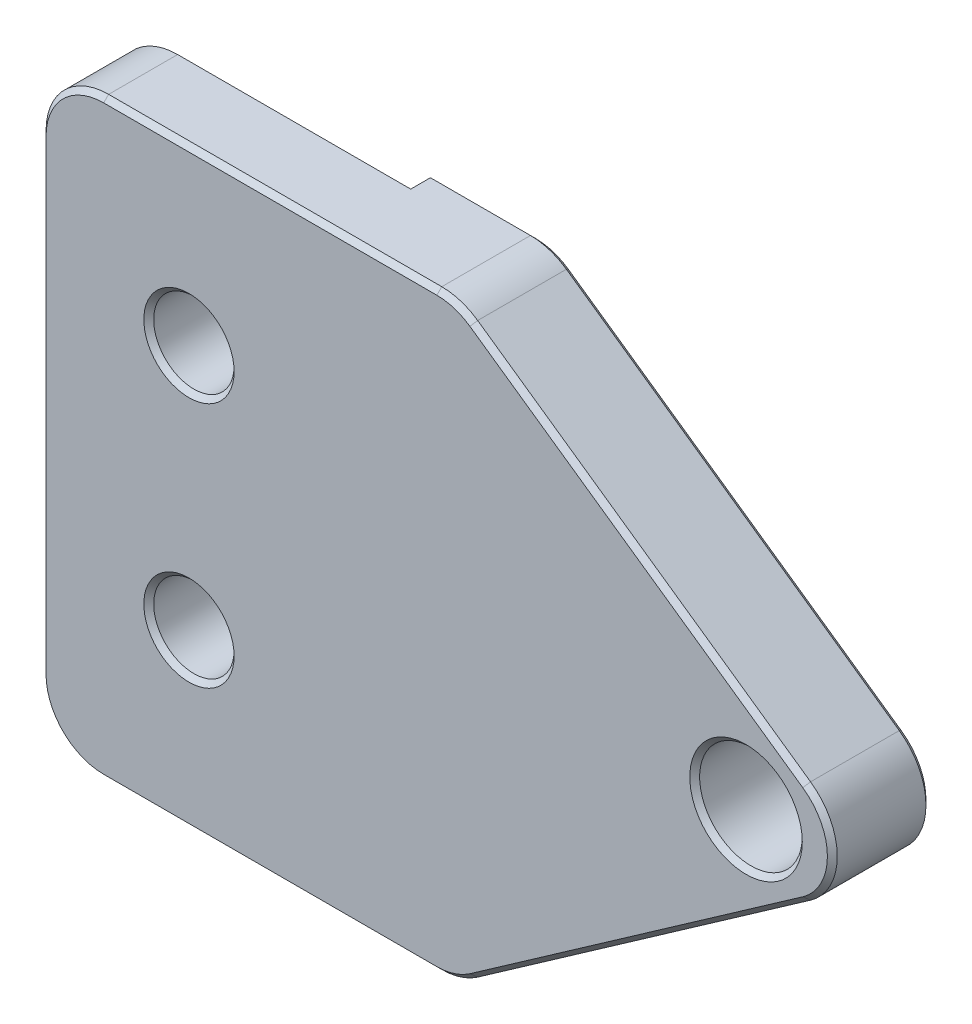
ISO-10303-21;
HEADER;
FILE_DESCRIPTION(('STEP AP214'),'2;1');
FILE_NAME('part.step','',(''),(''),'','','');
FILE_SCHEMA(('AUTOMOTIVE_DESIGN { 1 0 10303 214 1 1 1 1 }'));
ENDSEC;
DATA;
#1=APPLICATION_CONTEXT('core data for automotive mechanical design processes');
#2=APPLICATION_PROTOCOL_DEFINITION('international standard','automotive_design',2000,#1);
#3=PRODUCT_CONTEXT('',#1,'mechanical');
#4=PRODUCT('Part','Part','',(#3));
#5=PRODUCT_RELATED_PRODUCT_CATEGORY('part','',(#4));
#6=PRODUCT_DEFINITION_FORMATION('','',#4);
#7=PRODUCT_DEFINITION_CONTEXT('part definition',#1,'design');
#8=PRODUCT_DEFINITION('design','',#6,#7);
#9=PRODUCT_DEFINITION_SHAPE('','',#8);
#10=(LENGTH_UNIT() NAMED_UNIT(*) SI_UNIT(.MILLI.,.METRE.));
#11=(NAMED_UNIT(*) PLANE_ANGLE_UNIT() SI_UNIT($,.RADIAN.));
#12=(NAMED_UNIT(*) SI_UNIT($,.STERADIAN.) SOLID_ANGLE_UNIT());
#13=UNCERTAINTY_MEASURE_WITH_UNIT(LENGTH_MEASURE(1.E-05),#10,'distance_accuracy_value','');
#14=(GEOMETRIC_REPRESENTATION_CONTEXT(3) GLOBAL_UNCERTAINTY_ASSIGNED_CONTEXT((#13)) GLOBAL_UNIT_ASSIGNED_CONTEXT((#10,
#11,#12)) REPRESENTATION_CONTEXT('',''));
#15=CARTESIAN_POINT('',(0.,0.,0.));
#16=DIRECTION('',(0.,0.,1.));
#17=DIRECTION('',(1.,0.,0.));
#18=AXIS2_PLACEMENT_3D('',#15,#16,#17);
#19=CARTESIAN_POINT('',(-17.1377760809055,-12.,4.));
#20=DIRECTION('',(-0.573576436351044,0.819152044288993,0.));
#21=DIRECTION('',(-0.819152044288993,-0.573576436351044,0.));
#22=AXIS2_PLACEMENT_3D('',#19,#20,#21);
#23=PLANE('',#22);
#24=DIRECTION('',(0.,0.,-1.));
#25=VECTOR('',#24,1.);
#26=CARTESIAN_POINT('',(-2.97147071254595,-2.08064619249404,4.));
#27=LINE('',#26,#25);
#28=CARTESIAN_POINT('',(-2.97147071254595,-2.08064619249404,0.199999999999995));
#29=VERTEX_POINT('',#28);
#30=CARTESIAN_POINT('',(-2.97147071254595,-2.08064619249404,3.8));
#31=VERTEX_POINT('',#30);
#32=EDGE_CURVE('E230',#29,#31,#27,.F.);
#33=ORIENTED_EDGE('',*,*,#32,.T.);
#34=DIRECTION('',(-0.819152044288993,-0.573576436351044,0.));
#35=VECTOR('',#34,1.);
#36=CARTESIAN_POINT('',(-16.4817508563264,-11.540646192494,3.8));
#37=LINE('',#36,#35);
#38=CARTESIAN_POINT('',(-16.4817508563264,-11.540646192494,3.8));
#39=VERTEX_POINT('',#38);
#40=EDGE_CURVE('E299',#31,#39,#37,.T.);
#41=ORIENTED_EDGE('',*,*,#40,.T.);
#42=DIRECTION('',(0.,0.,-1.));
#43=VECTOR('',#42,1.);
#44=CARTESIAN_POINT('',(-16.4817508563264,-11.540646192494,4.));
#45=LINE('',#44,#43);
#46=CARTESIAN_POINT('',(-16.4817508563264,-11.540646192494,0.199999999999994));
#47=VERTEX_POINT('',#46);
#48=EDGE_CURVE('E233',#39,#47,#45,.T.);
#49=ORIENTED_EDGE('',*,*,#48,.T.);
#50=DIRECTION('',(0.819152044288993,0.573576436351044,0.));
#51=VECTOR('',#50,1.);
#52=CARTESIAN_POINT('',(-17.1377760809055,-12.,0.199999999999994));
#53=LINE('',#52,#51);
#54=EDGE_CURVE('E297',#47,#29,#53,.T.);
#55=ORIENTED_EDGE('',*,*,#54,.T.);
#56=EDGE_LOOP('',(#33,#41,#49,#55));
#57=FACE_BOUND('',#56,.T.);
#58=ADVANCED_FACE('F32',(#57),#23,.F.);
#59=CARTESIAN_POINT('',(0.,0.,4.));
#60=DIRECTION('',(-0.573576436351044,-0.819152044288993,0.));
#61=DIRECTION('',(0.819152044288993,-0.573576436351044,0.));
#62=AXIS2_PLACEMENT_3D('',#59,#60,#61);
#63=PLANE('',#62);
#64=DIRECTION('',(0.,0.,-1.));
#65=VECTOR('',#64,1.);
#66=CARTESIAN_POINT('',(-16.4817508563264,11.540646192494,4.));
#67=LINE('',#66,#65);
#68=CARTESIAN_POINT('',(-16.4817508563264,11.540646192494,0.199999999999995));
#69=VERTEX_POINT('',#68);
#70=CARTESIAN_POINT('',(-16.4817508563264,11.540646192494,3.8));
#71=VERTEX_POINT('',#70);
#72=EDGE_CURVE('E236',#69,#71,#67,.F.);
#73=ORIENTED_EDGE('',*,*,#72,.T.);
#74=DIRECTION('',(0.819152044288993,-0.573576436351044,0.));
#75=VECTOR('',#74,1.);
#76=CARTESIAN_POINT('',(-2.97147071254595,2.08064619249404,3.8));
#77=LINE('',#76,#75);
#78=CARTESIAN_POINT('',(-2.97147071254595,2.08064619249404,3.8));
#79=VERTEX_POINT('',#78);
#80=EDGE_CURVE('E291',#71,#79,#77,.T.);
#81=ORIENTED_EDGE('',*,*,#80,.T.);
#82=DIRECTION('',(0.,0.,-1.));
#83=VECTOR('',#82,1.);
#84=CARTESIAN_POINT('',(-2.97147071254595,2.08064619249404,4.));
#85=LINE('',#84,#83);
#86=CARTESIAN_POINT('',(-2.97147071254595,2.08064619249404,0.199999999999994));
#87=VERTEX_POINT('',#86);
#88=EDGE_CURVE('E239',#79,#87,#85,.T.);
#89=ORIENTED_EDGE('',*,*,#88,.T.);
#90=DIRECTION('',(-0.819152044288993,0.573576436351044,0.));
#91=VECTOR('',#90,1.);
#92=CARTESIAN_POINT('',(0.,0.,0.199999999999994));
#93=LINE('',#92,#91);
#94=EDGE_CURVE('E289',#87,#69,#93,.T.);
#95=ORIENTED_EDGE('',*,*,#94,.T.);
#96=EDGE_LOOP('',(#73,#81,#89,#95));
#97=FACE_BOUND('',#96,.T.);
#98=ADVANCED_FACE('F454',(#97),#63,.F.);
#99=CARTESIAN_POINT('',(-17.1377760809055,12.,4.));
#100=DIRECTION('',(0.,-1.,0.));
#101=DIRECTION('',(0.,0.,-1.));
#102=AXIS2_PLACEMENT_3D('',#99,#100,#101);
#103=PLANE('',#102);
#104=DIRECTION('',(0.,0.,-1.));
#105=VECTOR('',#104,1.);
#106=CARTESIAN_POINT('',(-31.46,12.,4.));
#107=LINE('',#106,#105);
#108=CARTESIAN_POINT('',(-31.46,12.,1.));
#109=VERTEX_POINT('',#108);
#110=CARTESIAN_POINT('',(-31.46,12.,3.8));
#111=VERTEX_POINT('',#110);
#112=EDGE_CURVE('E242',#109,#111,#107,.F.);
#113=ORIENTED_EDGE('',*,*,#112,.T.);
#114=DIRECTION('',(1.,0.,0.));
#115=VECTOR('',#114,1.);
#116=CARTESIAN_POINT('',(-17.9386350046581,12.,3.8));
#117=LINE('',#116,#115);
#118=CARTESIAN_POINT('',(-17.9386350046581,12.,3.8));
#119=VERTEX_POINT('',#118);
#120=EDGE_CURVE('E283',#111,#119,#117,.T.);
#121=ORIENTED_EDGE('',*,*,#120,.T.);
#122=DIRECTION('',(0.,0.,-1.));
#123=VECTOR('',#122,1.);
#124=CARTESIAN_POINT('',(-17.9386350046581,12.,4.));
#125=LINE('',#124,#123);
#126=CARTESIAN_POINT('',(-17.9386350046581,12.,0.199999999999995));
#127=VERTEX_POINT('',#126);
#128=EDGE_CURVE('E245',#119,#127,#125,.T.);
#129=ORIENTED_EDGE('',*,*,#128,.T.);
#130=DIRECTION('',(-1.,0.,0.));
#131=VECTOR('',#130,1.);
#132=CARTESIAN_POINT('',(-17.1377760809055,12.,0.199999999999995));
#133=LINE('',#132,#131);
#134=CARTESIAN_POINT('',(-22.,12.,0.199999999999995));
#135=VERTEX_POINT('',#134);
#136=EDGE_CURVE('E281',#127,#135,#133,.T.);
#137=ORIENTED_EDGE('',*,*,#136,.T.);
#138=DIRECTION('',(0.,0.,-1.));
#139=VECTOR('',#138,1.);
#140=CARTESIAN_POINT('',(-22.,12.,0.));
#141=LINE('',#140,#139);
#142=CARTESIAN_POINT('',(-22.,12.,1.));
#143=VERTEX_POINT('',#142);
#144=EDGE_CURVE('E187',#143,#135,#141,.T.);
#145=ORIENTED_EDGE('',*,*,#144,.F.);
#146=DIRECTION('',(1.,0.,0.));
#147=VECTOR('',#146,1.);
#148=CARTESIAN_POINT('',(-34.,12.,1.));
#149=LINE('',#148,#147);
#150=EDGE_CURVE('E193',#109,#143,#149,.T.);
#151=ORIENTED_EDGE('',*,*,#150,.F.);
#152=EDGE_LOOP('',(#113,#121,#129,#137,#145,#151));
#153=FACE_BOUND('',#152,.T.);
#154=ADVANCED_FACE('F389',(#153),#103,.F.);
#155=CARTESIAN_POINT('',(-34.,0.,4.));
#156=DIRECTION('',(1.,0.,0.));
#157=DIRECTION('',(0.,0.,-1.));
#158=AXIS2_PLACEMENT_3D('',#155,#156,#157);
#159=PLANE('',#158);
#160=DIRECTION('',(0.,0.,-1.));
#161=VECTOR('',#160,1.);
#162=CARTESIAN_POINT('',(-34.,-9.46,4.));
#163=LINE('',#162,#161);
#164=CARTESIAN_POINT('',(-34.,-9.46,1.));
#165=VERTEX_POINT('',#164);
#166=CARTESIAN_POINT('',(-34.,-9.46,3.8));
#167=VERTEX_POINT('',#166);
#168=EDGE_CURVE('E227',#165,#167,#163,.F.);
#169=ORIENTED_EDGE('',*,*,#168,.T.);
#170=DIRECTION('',(0.,1.,0.));
#171=VECTOR('',#170,1.);
#172=CARTESIAN_POINT('',(-34.,9.46,3.8));
#173=LINE('',#172,#171);
#174=CARTESIAN_POINT('',(-34.,9.46,3.8));
#175=VERTEX_POINT('',#174);
#176=EDGE_CURVE('E311',#167,#175,#173,.T.);
#177=ORIENTED_EDGE('',*,*,#176,.T.);
#178=DIRECTION('',(0.,0.,-1.));
#179=VECTOR('',#178,1.);
#180=CARTESIAN_POINT('',(-34.,9.46,4.));
#181=LINE('',#180,#179);
#182=CARTESIAN_POINT('',(-34.,9.46,1.));
#183=VERTEX_POINT('',#182);
#184=EDGE_CURVE('E225',#175,#183,#181,.T.);
#185=ORIENTED_EDGE('',*,*,#184,.T.);
#186=DIRECTION('',(0.,1.,0.));
#187=VECTOR('',#186,1.);
#188=CARTESIAN_POINT('',(-34.,-12.,1.));
#189=LINE('',#188,#187);
#190=EDGE_CURVE('E198',#165,#183,#189,.T.);
#191=ORIENTED_EDGE('',*,*,#190,.F.);
#192=EDGE_LOOP('',(#169,#177,#185,#191));
#193=FACE_BOUND('',#192,.T.);
#194=ADVANCED_FACE('F419',(#193),#159,.F.);
#195=CARTESIAN_POINT('',(-34.,-12.,4.));
#196=DIRECTION('',(0.,1.,0.));
#197=DIRECTION('',(0.,0.,1.));
#198=AXIS2_PLACEMENT_3D('',#195,#196,#197);
#199=PLANE('',#198);
#200=DIRECTION('',(0.,0.,-1.));
#201=VECTOR('',#200,1.);
#202=CARTESIAN_POINT('',(-17.9386350046581,-12.,4.));
#203=LINE('',#202,#201);
#204=CARTESIAN_POINT('',(-17.9386350046581,-12.,0.199999999999995));
#205=VERTEX_POINT('',#204);
#206=CARTESIAN_POINT('',(-17.9386350046581,-12.,3.8));
#207=VERTEX_POINT('',#206);
#208=EDGE_CURVE('E212',#205,#207,#203,.F.);
#209=ORIENTED_EDGE('',*,*,#208,.T.);
#210=DIRECTION('',(-1.,0.,0.));
#211=VECTOR('',#210,1.);
#212=CARTESIAN_POINT('',(-31.46,-12.,3.8));
#213=LINE('',#212,#211);
#214=CARTESIAN_POINT('',(-31.46,-12.,3.8));
#215=VERTEX_POINT('',#214);
#216=EDGE_CURVE('E307',#207,#215,#213,.T.);
#217=ORIENTED_EDGE('',*,*,#216,.T.);
#218=DIRECTION('',(0.,0.,-1.));
#219=VECTOR('',#218,1.);
#220=CARTESIAN_POINT('',(-31.46,-12.,4.));
#221=LINE('',#220,#219);
#222=CARTESIAN_POINT('',(-31.46,-12.,1.));
#223=VERTEX_POINT('',#222);
#224=EDGE_CURVE('E184',#215,#223,#221,.T.);
#225=ORIENTED_EDGE('',*,*,#224,.T.);
#226=DIRECTION('',(1.,0.,0.));
#227=VECTOR('',#226,1.);
#228=CARTESIAN_POINT('',(-34.,-12.,1.));
#229=LINE('',#228,#227);
#230=CARTESIAN_POINT('',(-22.,-12.,1.));
#231=VERTEX_POINT('',#230);
#232=EDGE_CURVE('E175',#223,#231,#229,.T.);
#233=ORIENTED_EDGE('',*,*,#232,.T.);
#234=DIRECTION('',(0.,0.,-1.));
#235=VECTOR('',#234,1.);
#236=CARTESIAN_POINT('',(-22.,-12.,0.));
#237=LINE('',#236,#235);
#238=CARTESIAN_POINT('',(-22.,-12.,0.199999999999995));
#239=VERTEX_POINT('',#238);
#240=EDGE_CURVE('E181',#231,#239,#237,.T.);
#241=ORIENTED_EDGE('',*,*,#240,.T.);
#242=DIRECTION('',(1.,0.,0.));
#243=VECTOR('',#242,1.);
#244=CARTESIAN_POINT('',(-34.,-12.,0.199999999999995));
#245=LINE('',#244,#243);
#246=EDGE_CURVE('E305',#239,#205,#245,.T.);
#247=ORIENTED_EDGE('',*,*,#246,.T.);
#248=EDGE_LOOP('',(#209,#217,#225,#233,#241,#247));
#249=FACE_BOUND('',#248,.T.);
#250=ADVANCED_FACE('F178',(#249),#199,.F.);
#251=CARTESIAN_POINT('',(0.,0.,4.));
#252=DIRECTION('',(0.,0.,1.));
#253=DIRECTION('',(1.,0.,0.));
#254=AXIS2_PLACEMENT_3D('',#251,#252,#253);
#255=PLANE('',#254);
#256=DIRECTION('',(-1.,0.,0.));
#257=VECTOR('',#256,1.);
#258=CARTESIAN_POINT('',(-31.46,11.8,4.));
#259=LINE('',#258,#257);
#260=CARTESIAN_POINT('',(-17.9386350046581,11.8,4.));
#261=VERTEX_POINT('',#260);
#262=CARTESIAN_POINT('',(-31.46,11.8,4.));
#263=VERTEX_POINT('',#262);
#264=EDGE_CURVE('E273',#261,#263,#259,.T.);
#265=ORIENTED_EDGE('',*,*,#264,.T.);
#266=CARTESIAN_POINT('',(-31.46,9.46,4.));
#267=DIRECTION('',(0.,0.,1.));
#268=DIRECTION('',(1.,0.,0.));
#269=AXIS2_PLACEMENT_3D('',#266,#267,#268);
#270=CIRCLE('',#269,2.33999999999999);
#271=CARTESIAN_POINT('',(-33.8,9.46,4.));
#272=VERTEX_POINT('',#271);
#273=EDGE_CURVE('E275',#263,#272,#270,.T.);
#274=ORIENTED_EDGE('',*,*,#273,.T.);
#275=DIRECTION('',(0.,-1.,0.));
#276=VECTOR('',#275,1.);
#277=CARTESIAN_POINT('',(-33.8,-9.46,4.));
#278=LINE('',#277,#276);
#279=CARTESIAN_POINT('',(-33.8,-9.46,4.));
#280=VERTEX_POINT('',#279);
#281=EDGE_CURVE('E257',#272,#280,#278,.T.);
#282=ORIENTED_EDGE('',*,*,#281,.T.);
#283=CARTESIAN_POINT('',(-31.46,-9.46,4.));
#284=DIRECTION('',(0.,0.,1.));
#285=DIRECTION('',(1.,0.,0.));
#286=AXIS2_PLACEMENT_3D('',#283,#284,#285);
#287=CIRCLE('',#286,2.33999999999999);
#288=CARTESIAN_POINT('',(-31.46,-11.8,4.));
#289=VERTEX_POINT('',#288);
#290=EDGE_CURVE('E259',#280,#289,#287,.T.);
#291=ORIENTED_EDGE('',*,*,#290,.T.);
#292=DIRECTION('',(1.,0.,0.));
#293=VECTOR('',#292,1.);
#294=CARTESIAN_POINT('',(-17.9386350046581,-11.8,4.));
#295=LINE('',#294,#293);
#296=CARTESIAN_POINT('',(-17.9386350046581,-11.8,4.));
#297=VERTEX_POINT('',#296);
#298=EDGE_CURVE('E261',#289,#297,#295,.T.);
#299=ORIENTED_EDGE('',*,*,#298,.T.);
#300=CARTESIAN_POINT('',(-17.9386350046581,-9.46,4.));
#301=DIRECTION('',(0.,0.,1.));
#302=DIRECTION('',(1.,0.,0.));
#303=AXIS2_PLACEMENT_3D('',#300,#301,#302);
#304=CIRCLE('',#303,2.34);
#305=CARTESIAN_POINT('',(-16.5964661435966,-11.3768157836362,4.));
#306=VERTEX_POINT('',#305);
#307=EDGE_CURVE('E263',#297,#306,#304,.T.);
#308=ORIENTED_EDGE('',*,*,#307,.T.);
#309=DIRECTION('',(0.819152044288993,0.573576436351044,0.));
#310=VECTOR('',#309,1.);
#311=CARTESIAN_POINT('',(-3.08618599981616,-1.91681578363624,4.));
#312=LINE('',#311,#310);
#313=CARTESIAN_POINT('',(-3.08618599981616,-1.91681578363624,4.));
#314=VERTEX_POINT('',#313);
#315=EDGE_CURVE('E265',#306,#314,#312,.T.);
#316=ORIENTED_EDGE('',*,*,#315,.T.);
#317=CARTESIAN_POINT('',(-4.4283548608776,0.,4.));
#318=DIRECTION('',(0.,0.,1.));
#319=DIRECTION('',(1.,0.,0.));
#320=AXIS2_PLACEMENT_3D('',#317,#318,#319);
#321=CIRCLE('',#320,2.33999999999999);
#322=CARTESIAN_POINT('',(-3.08618599981616,1.91681578363624,4.));
#323=VERTEX_POINT('',#322);
#324=EDGE_CURVE('E267',#314,#323,#321,.T.);
#325=ORIENTED_EDGE('',*,*,#324,.T.);
#326=DIRECTION('',(-0.819152044288993,0.573576436351044,0.));
#327=VECTOR('',#326,1.);
#328=CARTESIAN_POINT('',(-16.5964661435966,11.3768157836362,4.));
#329=LINE('',#328,#327);
#330=CARTESIAN_POINT('',(-16.5964661435966,11.3768157836362,4.));
#331=VERTEX_POINT('',#330);
#332=EDGE_CURVE('E269',#323,#331,#329,.T.);
#333=ORIENTED_EDGE('',*,*,#332,.T.);
#334=CARTESIAN_POINT('',(-17.9386350046581,9.46,4.));
#335=DIRECTION('',(0.,0.,1.));
#336=DIRECTION('',(1.,0.,0.));
#337=AXIS2_PLACEMENT_3D('',#334,#335,#336);
#338=CIRCLE('',#337,2.33999999999999);
#339=EDGE_CURVE('E271',#331,#261,#338,.T.);
#340=ORIENTED_EDGE('',*,*,#339,.T.);
#341=EDGE_LOOP('',(#265,#274,#282,#291,#299,#308,#316,#325,#333,#340));
#342=FACE_BOUND('',#341,.T.);
#343=CARTESIAN_POINT('',(-28.,-5.,4.));
#344=DIRECTION('',(0.,0.,1.));
#345=DIRECTION('',(1.,0.,0.));
#346=AXIS2_PLACEMENT_3D('',#343,#344,#345);
#347=CIRCLE('',#346,1.83194999999999);
#348=CARTESIAN_POINT('',(-26.16805,-5.,4.));
#349=VERTEX_POINT('',#348);
#350=EDGE_CURVE('E254',#349,#349,#347,.F.);
#351=ORIENTED_EDGE('',*,*,#350,.T.);
#352=EDGE_LOOP('',(#351));
#353=FACE_BOUND('',#352,.T.);
#354=CARTESIAN_POINT('',(-28.,5.,4.));
#355=DIRECTION('',(0.,0.,1.));
#356=DIRECTION('',(1.,0.,0.));
#357=AXIS2_PLACEMENT_3D('',#354,#355,#356);
#358=CIRCLE('',#357,1.83194999999999);
#359=CARTESIAN_POINT('',(-26.16805,5.,4.));
#360=VERTEX_POINT('',#359);
#361=EDGE_CURVE('E251',#360,#360,#358,.F.);
#362=ORIENTED_EDGE('',*,*,#361,.T.);
#363=EDGE_LOOP('',(#362));
#364=FACE_BOUND('',#363,.T.);
#365=CARTESIAN_POINT('',(-5.39,0.,4.));
#366=DIRECTION('',(0.,0.,1.));
#367=DIRECTION('',(1.,0.,0.));
#368=AXIS2_PLACEMENT_3D('',#365,#366,#367);
#369=CIRCLE('',#368,2.28279999999999);
#370=CARTESIAN_POINT('',(-3.10720000000001,0.,4.));
#371=VERTEX_POINT('',#370);
#372=EDGE_CURVE('E248',#371,#371,#369,.F.);
#373=ORIENTED_EDGE('',*,*,#372,.T.);
#374=EDGE_LOOP('',(#373));
#375=FACE_BOUND('',#374,.T.);
#376=ADVANCED_FACE('F444',(#342,#353,#364,#375),#255,.T.);
#377=CARTESIAN_POINT('',(0.,0.,0.));
#378=DIRECTION('',(0.,0.,1.));
#379=DIRECTION('',(1.,0.,0.));
#380=AXIS2_PLACEMENT_3D('',#377,#378,#379);
#381=PLANE('',#380);
#382=CARTESIAN_POINT('',(-5.39,0.,0.));
#383=DIRECTION('',(0.,0.,1.));
#384=DIRECTION('',(1.,0.,0.));
#385=AXIS2_PLACEMENT_3D('',#382,#383,#384);
#386=CIRCLE('',#385,2.0828);
#387=CARTESIAN_POINT('',(-3.3072,0.,0.));
#388=VERTEX_POINT('',#387);
#389=EDGE_CURVE('E214',#388,#388,#386,.T.);
#390=ORIENTED_EDGE('',*,*,#389,.T.);
#391=EDGE_LOOP('',(#390));
#392=FACE_BOUND('',#391,.T.);
#393=CARTESIAN_POINT('',(-17.9386350046581,-9.46,0.));
#394=DIRECTION('',(0.,0.,1.));
#395=DIRECTION('',(1.,0.,0.));
#396=AXIS2_PLACEMENT_3D('',#393,#394,#395);
#397=CIRCLE('',#396,2.34000000000001);
#398=CARTESIAN_POINT('',(-16.5964661435966,-11.3768157836362,0.));
#399=VERTEX_POINT('',#398);
#400=CARTESIAN_POINT('',(-17.9386350046581,-11.8,0.));
#401=VERTEX_POINT('',#400);
#402=EDGE_CURVE('E49',#399,#401,#397,.F.);
#403=ORIENTED_EDGE('',*,*,#402,.T.);
#404=DIRECTION('',(-1.,0.,0.));
#405=VECTOR('',#404,1.);
#406=CARTESIAN_POINT('',(0.,-11.8,0.));
#407=LINE('',#406,#405);
#408=CARTESIAN_POINT('',(-22.,-11.8,0.));
#409=VERTEX_POINT('',#408);
#410=EDGE_CURVE('E332',#401,#409,#407,.T.);
#411=ORIENTED_EDGE('',*,*,#410,.T.);
#412=DIRECTION('',(0.,1.,0.));
#413=VECTOR('',#412,1.);
#414=CARTESIAN_POINT('',(-22.,-12.,0.));
#415=LINE('',#414,#413);
#416=CARTESIAN_POINT('',(-22.,11.8,0.));
#417=VERTEX_POINT('',#416);
#418=EDGE_CURVE('E197',#409,#417,#415,.T.);
#419=ORIENTED_EDGE('',*,*,#418,.T.);
#420=DIRECTION('',(1.,0.,0.));
#421=VECTOR('',#420,1.);
#422=CARTESIAN_POINT('',(0.,11.8,0.));
#423=LINE('',#422,#421);
#424=CARTESIAN_POINT('',(-17.9386350046581,11.8,0.));
#425=VERTEX_POINT('',#424);
#426=EDGE_CURVE('E322',#417,#425,#423,.T.);
#427=ORIENTED_EDGE('',*,*,#426,.T.);
#428=CARTESIAN_POINT('',(-17.9386350046581,9.46,0.));
#429=DIRECTION('',(0.,0.,1.));
#430=DIRECTION('',(1.,0.,0.));
#431=AXIS2_PLACEMENT_3D('',#428,#429,#430);
#432=CIRCLE('',#431,2.34);
#433=CARTESIAN_POINT('',(-16.5964661435966,11.3768157836362,0.));
#434=VERTEX_POINT('',#433);
#435=EDGE_CURVE('E324',#425,#434,#432,.F.);
#436=ORIENTED_EDGE('',*,*,#435,.T.);
#437=DIRECTION('',(0.819152044288993,-0.573576436351044,0.));
#438=VECTOR('',#437,1.);
#439=CARTESIAN_POINT('',(-0.114715287270207,-0.163830408857795,0.));
#440=LINE('',#439,#438);
#441=CARTESIAN_POINT('',(-3.08618599981616,1.91681578363625,0.));
#442=VERTEX_POINT('',#441);
#443=EDGE_CURVE('E326',#434,#442,#440,.T.);
#444=ORIENTED_EDGE('',*,*,#443,.T.);
#445=CARTESIAN_POINT('',(-4.4283548608776,0.,0.));
#446=DIRECTION('',(0.,0.,1.));
#447=DIRECTION('',(1.,0.,0.));
#448=AXIS2_PLACEMENT_3D('',#445,#446,#447);
#449=CIRCLE('',#448,2.34);
#450=CARTESIAN_POINT('',(-3.08618599981616,-1.91681578363625,0.));
#451=VERTEX_POINT('',#450);
#452=EDGE_CURVE('E328',#442,#451,#449,.F.);
#453=ORIENTED_EDGE('',*,*,#452,.T.);
#454=DIRECTION('',(-0.819152044288993,-0.573576436351044,0.));
#455=VECTOR('',#454,1.);
#456=CARTESIAN_POINT('',(-0.114715287270207,0.163830408857795,0.));
#457=LINE('',#456,#455);
#458=EDGE_CURVE('E54',#451,#399,#457,.T.);
#459=ORIENTED_EDGE('',*,*,#458,.T.);
#460=EDGE_LOOP('',(#403,#411,#419,#427,#436,#444,#453,#459));
#461=FACE_BOUND('',#460,.T.);
#462=ADVANCED_FACE('F391',(#392,#461),#381,.F.);
#463=CARTESIAN_POINT('',(-22.,-12.,0.));
#464=DIRECTION('',(1.,0.,0.));
#465=DIRECTION('',(0.,0.,-1.));
#466=AXIS2_PLACEMENT_3D('',#463,#464,#465);
#467=PLANE('',#466);
#468=ORIENTED_EDGE('',*,*,#418,.F.);
#469=DIRECTION('',(0.,0.707106781186548,-0.707106781186548));
#470=VECTOR('',#469,1.);
#471=CARTESIAN_POINT('',(-22.,-12.,0.199999999999995));
#472=LINE('',#471,#470);
#473=EDGE_CURVE('E11',#409,#239,#472,.F.);
#474=ORIENTED_EDGE('',*,*,#473,.T.);
#475=ORIENTED_EDGE('',*,*,#240,.F.);
#476=DIRECTION('',(0.,1.,0.));
#477=VECTOR('',#476,1.);
#478=CARTESIAN_POINT('',(-22.,-12.,1.));
#479=LINE('',#478,#477);
#480=EDGE_CURVE('E190',#231,#143,#479,.T.);
#481=ORIENTED_EDGE('',*,*,#480,.T.);
#482=ORIENTED_EDGE('',*,*,#144,.T.);
#483=DIRECTION('',(0.,0.707106781186548,0.707106781186548));
#484=VECTOR('',#483,1.);
#485=CARTESIAN_POINT('',(-22.,12.,0.199999999999995));
#486=LINE('',#485,#484);
#487=EDGE_CURVE('E41',#135,#417,#486,.F.);
#488=ORIENTED_EDGE('',*,*,#487,.T.);
#489=EDGE_LOOP('',(#468,#474,#475,#481,#482,#488));
#490=FACE_BOUND('',#489,.T.);
#491=ADVANCED_FACE('F201',(#490),#467,.F.);
#492=CARTESIAN_POINT('',(-34.,-12.,1.));
#493=DIRECTION('',(0.,0.,1.));
#494=DIRECTION('',(1.,0.,0.));
#495=AXIS2_PLACEMENT_3D('',#492,#493,#494);
#496=PLANE('',#495);
#497=CARTESIAN_POINT('',(-28.,5.,1.));
#498=DIRECTION('',(0.,0.,1.));
#499=DIRECTION('',(1.,0.,0.));
#500=AXIS2_PLACEMENT_3D('',#497,#498,#499);
#501=CIRCLE('',#500,1.63195);
#502=CARTESIAN_POINT('',(-26.36805,5.,1.));
#503=VERTEX_POINT('',#502);
#504=EDGE_CURVE('E217',#503,#503,#501,.T.);
#505=ORIENTED_EDGE('',*,*,#504,.T.);
#506=EDGE_LOOP('',(#505));
#507=FACE_BOUND('',#506,.T.);
#508=CARTESIAN_POINT('',(-28.,-5.,1.));
#509=DIRECTION('',(0.,0.,1.));
#510=DIRECTION('',(1.,0.,0.));
#511=AXIS2_PLACEMENT_3D('',#508,#509,#510);
#512=CIRCLE('',#511,1.63195);
#513=CARTESIAN_POINT('',(-26.36805,-5.,1.));
#514=VERTEX_POINT('',#513);
#515=EDGE_CURVE('E209',#514,#514,#512,.T.);
#516=ORIENTED_EDGE('',*,*,#515,.T.);
#517=EDGE_LOOP('',(#516));
#518=FACE_BOUND('',#517,.T.);
#519=ORIENTED_EDGE('',*,*,#232,.F.);
#520=CARTESIAN_POINT('',(-31.46,-9.46,1.));
#521=DIRECTION('',(0.,0.,1.));
#522=DIRECTION('',(1.,0.,0.));
#523=AXIS2_PLACEMENT_3D('',#520,#521,#522);
#524=CIRCLE('',#523,2.54);
#525=EDGE_CURVE('E223',#223,#165,#524,.F.);
#526=ORIENTED_EDGE('',*,*,#525,.T.);
#527=ORIENTED_EDGE('',*,*,#190,.T.);
#528=CARTESIAN_POINT('',(-31.46,9.46,1.));
#529=DIRECTION('',(0.,0.,1.));
#530=DIRECTION('',(1.,0.,0.));
#531=AXIS2_PLACEMENT_3D('',#528,#529,#530);
#532=CIRCLE('',#531,2.54);
#533=EDGE_CURVE('E221',#183,#109,#532,.F.);
#534=ORIENTED_EDGE('',*,*,#533,.T.);
#535=ORIENTED_EDGE('',*,*,#150,.T.);
#536=ORIENTED_EDGE('',*,*,#480,.F.);
#537=EDGE_LOOP('',(#519,#526,#527,#534,#535,#536));
#538=FACE_BOUND('',#537,.T.);
#539=ADVANCED_FACE('F191',(#507,#518,#538),#496,.F.);
#540=CARTESIAN_POINT('',(-28.,-5.,4.));
#541=DIRECTION('',(0.,0.,1.));
#542=DIRECTION('',(1.,0.,0.));
#543=AXIS2_PLACEMENT_3D('',#540,#541,#542);
#544=CYLINDRICAL_SURFACE('',#543,1.63195);
#545=CARTESIAN_POINT('',(-28.,-5.,3.80000000000001));
#546=DIRECTION('',(0.,0.,1.));
#547=DIRECTION('',(1.,0.,0.));
#548=AXIS2_PLACEMENT_3D('',#545,#546,#547);
#549=CIRCLE('',#548,1.63195);
#550=CARTESIAN_POINT('',(-26.36805,-5.,3.80000000000001));
#551=VERTEX_POINT('',#550);
#552=EDGE_CURVE('E313',#551,#551,#549,.T.);
#553=ORIENTED_EDGE('',*,*,#552,.T.);
#554=EDGE_LOOP('',(#553));
#555=FACE_BOUND('',#554,.T.);
#556=ORIENTED_EDGE('',*,*,#515,.F.);
#557=EDGE_LOOP('',(#556));
#558=FACE_BOUND('',#557,.T.);
#559=ADVANCED_FACE('F708',(#555,#558),#544,.F.);
#560=CARTESIAN_POINT('',(-28.,5.,4.));
#561=DIRECTION('',(0.,0.,1.));
#562=DIRECTION('',(1.,0.,0.));
#563=AXIS2_PLACEMENT_3D('',#560,#561,#562);
#564=CYLINDRICAL_SURFACE('',#563,1.63195);
#565=CARTESIAN_POINT('',(-28.,5.,3.80000000000001));
#566=DIRECTION('',(0.,0.,1.));
#567=DIRECTION('',(1.,0.,0.));
#568=AXIS2_PLACEMENT_3D('',#565,#566,#567);
#569=CIRCLE('',#568,1.63195);
#570=CARTESIAN_POINT('',(-26.36805,5.,3.80000000000001));
#571=VERTEX_POINT('',#570);
#572=EDGE_CURVE('E316',#571,#571,#569,.T.);
#573=ORIENTED_EDGE('',*,*,#572,.T.);
#574=EDGE_LOOP('',(#573));
#575=FACE_BOUND('',#574,.T.);
#576=ORIENTED_EDGE('',*,*,#504,.F.);
#577=EDGE_LOOP('',(#576));
#578=FACE_BOUND('',#577,.T.);
#579=ADVANCED_FACE('F698',(#575,#578),#564,.F.);
#580=CARTESIAN_POINT('',(-5.39,0.,4.));
#581=DIRECTION('',(0.,0.,1.));
#582=DIRECTION('',(1.,0.,0.));
#583=AXIS2_PLACEMENT_3D('',#580,#581,#582);
#584=CYLINDRICAL_SURFACE('',#583,2.0828);
#585=CARTESIAN_POINT('',(-5.39,0.,3.80000000000001));
#586=DIRECTION('',(0.,0.,1.));
#587=DIRECTION('',(1.,0.,0.));
#588=AXIS2_PLACEMENT_3D('',#585,#586,#587);
#589=CIRCLE('',#588,2.0828);
#590=CARTESIAN_POINT('',(-3.3072,0.,3.80000000000001));
#591=VERTEX_POINT('',#590);
#592=EDGE_CURVE('E319',#591,#591,#589,.T.);
#593=ORIENTED_EDGE('',*,*,#592,.T.);
#594=EDGE_LOOP('',(#593));
#595=FACE_BOUND('',#594,.T.);
#596=ORIENTED_EDGE('',*,*,#389,.F.);
#597=EDGE_LOOP('',(#596));
#598=FACE_BOUND('',#597,.T.);
#599=ADVANCED_FACE('F495',(#595,#598),#584,.F.);
#600=CARTESIAN_POINT('',(-31.46,-9.46,4.));
#601=DIRECTION('',(0.,0.,-1.));
#602=DIRECTION('',(-1.,0.,0.));
#603=AXIS2_PLACEMENT_3D('',#600,#601,#602);
#604=CYLINDRICAL_SURFACE('',#603,2.54);
#605=ORIENTED_EDGE('',*,*,#224,.F.);
#606=CARTESIAN_POINT('',(-31.46,-9.46,3.8));
#607=DIRECTION('',(0.,0.,1.));
#608=DIRECTION('',(1.,0.,0.));
#609=AXIS2_PLACEMENT_3D('',#606,#607,#608);
#610=CIRCLE('',#609,2.54);
#611=EDGE_CURVE('E309',#215,#167,#610,.F.);
#612=ORIENTED_EDGE('',*,*,#611,.T.);
#613=ORIENTED_EDGE('',*,*,#168,.F.);
#614=ORIENTED_EDGE('',*,*,#525,.F.);
#615=EDGE_LOOP('',(#605,#612,#613,#614));
#616=FACE_BOUND('',#615,.T.);
#617=ADVANCED_FACE('F415',(#616),#604,.T.);
#618=CARTESIAN_POINT('',(-17.9386350046581,-9.46,4.));
#619=DIRECTION('',(0.,0.,-1.));
#620=DIRECTION('',(-1.,0.,0.));
#621=AXIS2_PLACEMENT_3D('',#618,#619,#620);
#622=CYLINDRICAL_SURFACE('',#621,2.54);
#623=ORIENTED_EDGE('',*,*,#48,.F.);
#624=CARTESIAN_POINT('',(-17.9386350046581,-9.46,3.8));
#625=DIRECTION('',(0.,0.,1.));
#626=DIRECTION('',(1.,0.,0.));
#627=AXIS2_PLACEMENT_3D('',#624,#625,#626);
#628=CIRCLE('',#627,2.54);
#629=EDGE_CURVE('E303',#39,#207,#628,.F.);
#630=ORIENTED_EDGE('',*,*,#629,.T.);
#631=ORIENTED_EDGE('',*,*,#208,.F.);
#632=CARTESIAN_POINT('',(-17.9386350046581,-9.46,0.199999999999995));
#633=DIRECTION('',(0.,0.,1.));
#634=DIRECTION('',(1.,0.,0.));
#635=AXIS2_PLACEMENT_3D('',#632,#633,#634);
#636=CIRCLE('',#635,2.54);
#637=EDGE_CURVE('E301',#205,#47,#636,.T.);
#638=ORIENTED_EDGE('',*,*,#637,.T.);
#639=EDGE_LOOP('',(#623,#630,#631,#638));
#640=FACE_BOUND('',#639,.T.);
#641=ADVANCED_FACE('F402',(#640),#622,.T.);
#642=CARTESIAN_POINT('',(-4.4283548608776,0.,4.));
#643=DIRECTION('',(0.,0.,-1.));
#644=DIRECTION('',(-1.,0.,0.));
#645=AXIS2_PLACEMENT_3D('',#642,#643,#644);
#646=CYLINDRICAL_SURFACE('',#645,2.54);
#647=ORIENTED_EDGE('',*,*,#88,.F.);
#648=CARTESIAN_POINT('',(-4.4283548608776,0.,3.8));
#649=DIRECTION('',(0.,0.,1.));
#650=DIRECTION('',(1.,0.,0.));
#651=AXIS2_PLACEMENT_3D('',#648,#649,#650);
#652=CIRCLE('',#651,2.54);
#653=EDGE_CURVE('E295',#79,#31,#652,.F.);
#654=ORIENTED_EDGE('',*,*,#653,.T.);
#655=ORIENTED_EDGE('',*,*,#32,.F.);
#656=CARTESIAN_POINT('',(-4.4283548608776,0.,0.199999999999995));
#657=DIRECTION('',(0.,0.,1.));
#658=DIRECTION('',(1.,0.,0.));
#659=AXIS2_PLACEMENT_3D('',#656,#657,#658);
#660=CIRCLE('',#659,2.54);
#661=EDGE_CURVE('E293',#29,#87,#660,.T.);
#662=ORIENTED_EDGE('',*,*,#661,.T.);
#663=EDGE_LOOP('',(#647,#654,#655,#662));
#664=FACE_BOUND('',#663,.T.);
#665=ADVANCED_FACE('F457',(#664),#646,.T.);
#666=CARTESIAN_POINT('',(-17.9386350046581,9.46,4.));
#667=DIRECTION('',(0.,0.,-1.));
#668=DIRECTION('',(-1.,0.,0.));
#669=AXIS2_PLACEMENT_3D('',#666,#667,#668);
#670=CYLINDRICAL_SURFACE('',#669,2.54);
#671=ORIENTED_EDGE('',*,*,#128,.F.);
#672=CARTESIAN_POINT('',(-17.9386350046581,9.46,3.8));
#673=DIRECTION('',(0.,0.,1.));
#674=DIRECTION('',(1.,0.,0.));
#675=AXIS2_PLACEMENT_3D('',#672,#673,#674);
#676=CIRCLE('',#675,2.54);
#677=EDGE_CURVE('E287',#119,#71,#676,.F.);
#678=ORIENTED_EDGE('',*,*,#677,.T.);
#679=ORIENTED_EDGE('',*,*,#72,.F.);
#680=CARTESIAN_POINT('',(-17.9386350046581,9.46,0.199999999999995));
#681=DIRECTION('',(0.,0.,1.));
#682=DIRECTION('',(1.,0.,0.));
#683=AXIS2_PLACEMENT_3D('',#680,#681,#682);
#684=CIRCLE('',#683,2.54);
#685=EDGE_CURVE('E285',#69,#127,#684,.T.);
#686=ORIENTED_EDGE('',*,*,#685,.T.);
#687=EDGE_LOOP('',(#671,#678,#679,#686));
#688=FACE_BOUND('',#687,.T.);
#689=ADVANCED_FACE('F433',(#688),#670,.T.);
#690=CARTESIAN_POINT('',(-31.46,9.46,4.));
#691=DIRECTION('',(0.,0.,-1.));
#692=DIRECTION('',(-1.,0.,0.));
#693=AXIS2_PLACEMENT_3D('',#690,#691,#692);
#694=CYLINDRICAL_SURFACE('',#693,2.54);
#695=ORIENTED_EDGE('',*,*,#184,.F.);
#696=CARTESIAN_POINT('',(-31.46,9.46,3.8));
#697=DIRECTION('',(0.,0.,1.));
#698=DIRECTION('',(1.,0.,0.));
#699=AXIS2_PLACEMENT_3D('',#696,#697,#698);
#700=CIRCLE('',#699,2.54);
#701=EDGE_CURVE('E278',#175,#111,#700,.F.);
#702=ORIENTED_EDGE('',*,*,#701,.T.);
#703=ORIENTED_EDGE('',*,*,#112,.F.);
#704=ORIENTED_EDGE('',*,*,#533,.F.);
#705=EDGE_LOOP('',(#695,#702,#703,#704));
#706=FACE_BOUND('',#705,.T.);
#707=ADVANCED_FACE('F427',(#706),#694,.T.);
#708=CARTESIAN_POINT('',(-0.114715287270214,0.163830408857805,4.));
#709=DIRECTION('',(0.405579787672629,-0.579227965339558,0.707106781186563));
#710=DIRECTION('',(0.,-0.773589321594968,-0.633687274224626));
#711=AXIS2_PLACEMENT_3D('',#708,#709,#710);
#712=PLANE('',#711);
#713=DIRECTION('',(-0.405579787672644,0.579227965339579,0.707106781186537));
#714=VECTOR('',#713,1.);
#715=CARTESIAN_POINT('',(-16.4817508563264,-11.540646192494,3.8));
#716=LINE('',#715,#714);
#717=EDGE_CURVE('E357',#39,#306,#716,.T.);
#718=ORIENTED_EDGE('',*,*,#717,.F.);
#719=ORIENTED_EDGE('',*,*,#40,.F.);
#720=DIRECTION('',(0.405579787672645,-0.57922796533958,-0.707106781186535));
#721=VECTOR('',#720,1.);
#722=CARTESIAN_POINT('',(-3.08618599981616,-1.91681578363624,4.));
#723=LINE('',#722,#721);
#724=EDGE_CURVE('E218',#314,#31,#723,.T.);
#725=ORIENTED_EDGE('',*,*,#724,.F.);
#726=ORIENTED_EDGE('',*,*,#315,.F.);
#727=EDGE_LOOP('',(#718,#719,#725,#726));
#728=FACE_BOUND('',#727,.T.);
#729=ADVANCED_FACE('F466',(#728),#712,.T.);
#730=CARTESIAN_POINT('',(-4.4283548608776,0.,4.));
#731=DIRECTION('',(0.,0.,-1.));
#732=DIRECTION('',(-1.,0.,0.));
#733=AXIS2_PLACEMENT_3D('',#730,#731,#732);
#734=CONICAL_SURFACE('',#733,2.33999999999999,0.785398163397467);
#735=ORIENTED_EDGE('',*,*,#724,.T.);
#736=ORIENTED_EDGE('',*,*,#653,.F.);
#737=DIRECTION('',(0.405579787672644,0.579227965339581,-0.707106781186535));
#738=VECTOR('',#737,1.);
#739=CARTESIAN_POINT('',(-3.08618599981616,1.91681578363624,4.));
#740=LINE('',#739,#738);
#741=EDGE_CURVE('E354',#323,#79,#740,.T.);
#742=ORIENTED_EDGE('',*,*,#741,.F.);
#743=ORIENTED_EDGE('',*,*,#324,.F.);
#744=EDGE_LOOP('',(#735,#736,#742,#743));
#745=FACE_BOUND('',#744,.T.);
#746=ADVANCED_FACE('F461',(#745),#734,.T.);
#747=CARTESIAN_POINT('',(-17.9386350046581,-9.46,4.));
#748=DIRECTION('',(0.,0.,-1.));
#749=DIRECTION('',(-1.,0.,0.));
#750=AXIS2_PLACEMENT_3D('',#747,#748,#749);
#751=CONICAL_SURFACE('',#750,2.33999999999999,0.785398163397465);
#752=ORIENTED_EDGE('',*,*,#717,.T.);
#753=ORIENTED_EDGE('',*,*,#307,.F.);
#754=DIRECTION('',(0.,0.70710678118656,0.707106781186535));
#755=VECTOR('',#754,1.);
#756=CARTESIAN_POINT('',(-17.9386350046581,-12.,3.8));
#757=LINE('',#756,#755);
#758=EDGE_CURVE('E351',#207,#297,#757,.T.);
#759=ORIENTED_EDGE('',*,*,#758,.F.);
#760=ORIENTED_EDGE('',*,*,#629,.F.);
#761=EDGE_LOOP('',(#752,#753,#759,#760));
#762=FACE_BOUND('',#761,.T.);
#763=ADVANCED_FACE('F406',(#762),#751,.T.);
#764=CARTESIAN_POINT('',(-0.114715287270213,-0.163830408857803,4.));
#765=DIRECTION('',(0.405579787672631,0.57922796533956,0.70710678118656));
#766=DIRECTION('',(0.,-0.773589321594966,0.633687274224629));
#767=AXIS2_PLACEMENT_3D('',#764,#765,#766);
#768=PLANE('',#767);
#769=ORIENTED_EDGE('',*,*,#741,.T.);
#770=ORIENTED_EDGE('',*,*,#80,.F.);
#771=DIRECTION('',(0.405579787672647,0.579227965339577,-0.707106781186537));
#772=VECTOR('',#771,1.);
#773=CARTESIAN_POINT('',(-16.5964661435966,11.3768157836362,4.));
#774=LINE('',#773,#772);
#775=EDGE_CURVE('E348',#331,#71,#774,.T.);
#776=ORIENTED_EDGE('',*,*,#775,.F.);
#777=ORIENTED_EDGE('',*,*,#332,.F.);
#778=EDGE_LOOP('',(#769,#770,#776,#777));
#779=FACE_BOUND('',#778,.T.);
#780=ADVANCED_FACE('F451',(#779),#768,.T.);
#781=CARTESIAN_POINT('',(0.,-11.8,4.));
#782=DIRECTION('',(0.,-0.707106781186535,0.70710678118656));
#783=DIRECTION('',(0.,-0.70710678118656,-0.707106781186535));
#784=AXIS2_PLACEMENT_3D('',#781,#782,#783);
#785=PLANE('',#784);
#786=ORIENTED_EDGE('',*,*,#758,.T.);
#787=ORIENTED_EDGE('',*,*,#298,.F.);
#788=DIRECTION('',(0.,0.70710678118656,0.707106781186535));
#789=VECTOR('',#788,1.);
#790=CARTESIAN_POINT('',(-31.46,-12.,3.8));
#791=LINE('',#790,#789);
#792=EDGE_CURVE('E345',#215,#289,#791,.T.);
#793=ORIENTED_EDGE('',*,*,#792,.F.);
#794=ORIENTED_EDGE('',*,*,#216,.F.);
#795=EDGE_LOOP('',(#786,#787,#793,#794));
#796=FACE_BOUND('',#795,.T.);
#797=ADVANCED_FACE('F412',(#796),#785,.T.);
#798=CARTESIAN_POINT('',(-17.9386350046581,9.46,4.));
#799=DIRECTION('',(0.,0.,-1.));
#800=DIRECTION('',(-1.,0.,0.));
#801=AXIS2_PLACEMENT_3D('',#798,#799,#800);
#802=CONICAL_SURFACE('',#801,2.33999999999999,0.785398163397467);
#803=ORIENTED_EDGE('',*,*,#775,.T.);
#804=ORIENTED_EDGE('',*,*,#677,.F.);
#805=DIRECTION('',(0.,0.707106781186563,-0.707106781186532));
#806=VECTOR('',#805,1.);
#807=CARTESIAN_POINT('',(-17.9386350046581,11.8,4.));
#808=LINE('',#807,#806);
#809=EDGE_CURVE('E342',#261,#119,#808,.T.);
#810=ORIENTED_EDGE('',*,*,#809,.F.);
#811=ORIENTED_EDGE('',*,*,#339,.F.);
#812=EDGE_LOOP('',(#803,#804,#810,#811));
#813=FACE_BOUND('',#812,.T.);
#814=ADVANCED_FACE('F437',(#813),#802,.T.);
#815=CARTESIAN_POINT('',(-31.46,-9.46,4.));
#816=DIRECTION('',(0.,0.,-1.));
#817=DIRECTION('',(-1.,0.,0.));
#818=AXIS2_PLACEMENT_3D('',#815,#816,#817);
#819=CONICAL_SURFACE('',#818,2.33999999999999,0.785398163397465);
#820=ORIENTED_EDGE('',*,*,#792,.T.);
#821=ORIENTED_EDGE('',*,*,#290,.F.);
#822=DIRECTION('',(0.70710678118656,0.,0.707106781186535));
#823=VECTOR('',#822,1.);
#824=CARTESIAN_POINT('',(-34.,-9.46,3.8));
#825=LINE('',#824,#823);
#826=EDGE_CURVE('E339',#167,#280,#825,.T.);
#827=ORIENTED_EDGE('',*,*,#826,.F.);
#828=ORIENTED_EDGE('',*,*,#611,.F.);
#829=EDGE_LOOP('',(#820,#821,#827,#828));
#830=FACE_BOUND('',#829,.T.);
#831=ADVANCED_FACE('F515',(#830),#819,.T.);
#832=CARTESIAN_POINT('',(0.,11.8,4.));
#833=DIRECTION('',(0.,0.707106781186535,0.70710678118656));
#834=DIRECTION('',(0.,-0.70710678118656,0.707106781186535));
#835=AXIS2_PLACEMENT_3D('',#832,#833,#834);
#836=PLANE('',#835);
#837=ORIENTED_EDGE('',*,*,#809,.T.);
#838=ORIENTED_EDGE('',*,*,#120,.F.);
#839=DIRECTION('',(0.,0.70710678118656,-0.707106781186535));
#840=VECTOR('',#839,1.);
#841=CARTESIAN_POINT('',(-31.46,11.8,4.));
#842=LINE('',#841,#840);
#843=EDGE_CURVE('E337',#263,#111,#842,.T.);
#844=ORIENTED_EDGE('',*,*,#843,.F.);
#845=ORIENTED_EDGE('',*,*,#264,.F.);
#846=EDGE_LOOP('',(#837,#838,#844,#845));
#847=FACE_BOUND('',#846,.T.);
#848=ADVANCED_FACE('F441',(#847),#836,.T.);
#849=CARTESIAN_POINT('',(-33.8,0.,4.));
#850=DIRECTION('',(-0.707106781186535,0.,0.70710678118656));
#851=DIRECTION('',(0.70710678118656,0.,0.707106781186535));
#852=AXIS2_PLACEMENT_3D('',#849,#850,#851);
#853=PLANE('',#852);
#854=ORIENTED_EDGE('',*,*,#826,.T.);
#855=ORIENTED_EDGE('',*,*,#281,.F.);
#856=DIRECTION('',(0.70710678118656,0.,0.707106781186535));
#857=VECTOR('',#856,1.);
#858=CARTESIAN_POINT('',(-34.,9.46,3.8));
#859=LINE('',#858,#857);
#860=EDGE_CURVE('E335',#175,#272,#859,.T.);
#861=ORIENTED_EDGE('',*,*,#860,.F.);
#862=ORIENTED_EDGE('',*,*,#176,.F.);
#863=EDGE_LOOP('',(#854,#855,#861,#862));
#864=FACE_BOUND('',#863,.T.);
#865=ADVANCED_FACE('F508',(#864),#853,.T.);
#866=CARTESIAN_POINT('',(-31.46,9.46,4.));
#867=DIRECTION('',(0.,0.,-1.));
#868=DIRECTION('',(-1.,0.,0.));
#869=AXIS2_PLACEMENT_3D('',#866,#867,#868);
#870=CONICAL_SURFACE('',#869,2.33999999999999,0.785398163397465);
#871=ORIENTED_EDGE('',*,*,#843,.T.);
#872=ORIENTED_EDGE('',*,*,#701,.F.);
#873=ORIENTED_EDGE('',*,*,#860,.T.);
#874=ORIENTED_EDGE('',*,*,#273,.F.);
#875=EDGE_LOOP('',(#871,#872,#873,#874));
#876=FACE_BOUND('',#875,.T.);
#877=ADVANCED_FACE('F504',(#876),#870,.T.);
#878=CARTESIAN_POINT('',(-28.,-5.,3.80000000000001));
#879=DIRECTION('',(0.,0.,1.));
#880=DIRECTION('',(1.,0.,0.));
#881=AXIS2_PLACEMENT_3D('',#878,#879,#880);
#882=CONICAL_SURFACE('',#881,1.63195,0.785398163397461);
#883=ORIENTED_EDGE('',*,*,#350,.F.);
#884=EDGE_LOOP('',(#883));
#885=FACE_BOUND('',#884,.T.);
#886=ORIENTED_EDGE('',*,*,#552,.F.);
#887=EDGE_LOOP('',(#886));
#888=FACE_BOUND('',#887,.T.);
#889=ADVANCED_FACE('F507',(#885,#888),#882,.F.);
#890=CARTESIAN_POINT('',(-28.,5.,3.80000000000001));
#891=DIRECTION('',(0.,0.,1.));
#892=DIRECTION('',(1.,0.,0.));
#893=AXIS2_PLACEMENT_3D('',#890,#891,#892);
#894=CONICAL_SURFACE('',#893,1.63195,0.785398163397461);
#895=ORIENTED_EDGE('',*,*,#361,.F.);
#896=EDGE_LOOP('',(#895));
#897=FACE_BOUND('',#896,.T.);
#898=ORIENTED_EDGE('',*,*,#572,.F.);
#899=EDGE_LOOP('',(#898));
#900=FACE_BOUND('',#899,.T.);
#901=ADVANCED_FACE('F533',(#897,#900),#894,.F.);
#902=CARTESIAN_POINT('',(-5.39,0.,3.80000000000001));
#903=DIRECTION('',(0.,0.,1.));
#904=DIRECTION('',(1.,0.,0.));
#905=AXIS2_PLACEMENT_3D('',#902,#903,#904);
#906=CONICAL_SURFACE('',#905,2.0828,0.785398163397456);
#907=ORIENTED_EDGE('',*,*,#372,.F.);
#908=EDGE_LOOP('',(#907));
#909=FACE_BOUND('',#908,.T.);
#910=ORIENTED_EDGE('',*,*,#592,.F.);
#911=EDGE_LOOP('',(#910));
#912=FACE_BOUND('',#911,.T.);
#913=ADVANCED_FACE('F537',(#909,#912),#906,.F.);
#914=CARTESIAN_POINT('',(-17.1377760809055,12.,0.199999999999995));
#915=DIRECTION('',(0.,-0.707106781186547,0.707106781186547));
#916=DIRECTION('',(0.,-0.707106781186548,-0.707106781186548));
#917=AXIS2_PLACEMENT_3D('',#914,#915,#916);
#918=PLANE('',#917);
#919=ORIENTED_EDGE('',*,*,#487,.F.);
#920=ORIENTED_EDGE('',*,*,#136,.F.);
#921=DIRECTION('',(0.,0.707106781186547,0.707106781186547));
#922=VECTOR('',#921,1.);
#923=CARTESIAN_POINT('',(-17.9386350046581,11.8,0.));
#924=LINE('',#923,#922);
#925=EDGE_CURVE('E36',#425,#127,#924,.T.);
#926=ORIENTED_EDGE('',*,*,#925,.F.);
#927=ORIENTED_EDGE('',*,*,#426,.F.);
#928=EDGE_LOOP('',(#919,#920,#926,#927));
#929=FACE_BOUND('',#928,.T.);
#930=ADVANCED_FACE('F34',(#929),#918,.F.);
#931=CARTESIAN_POINT('',(-17.9386350046581,9.46,0.));
#932=DIRECTION('',(0.,0.,1.));
#933=DIRECTION('',(1.,0.,0.));
#934=AXIS2_PLACEMENT_3D('',#931,#932,#933);
#935=CONICAL_SURFACE('',#934,2.34,0.785398163397448);
#936=ORIENTED_EDGE('',*,*,#925,.T.);
#937=ORIENTED_EDGE('',*,*,#685,.F.);
#938=DIRECTION('',(0.405579787672635,0.579227965339571,0.707106781186548));
#939=VECTOR('',#938,1.);
#940=CARTESIAN_POINT('',(-16.5964661435966,11.3768157836362,0.));
#941=LINE('',#940,#939);
#942=EDGE_CURVE('E372',#434,#69,#941,.T.);
#943=ORIENTED_EDGE('',*,*,#942,.F.);
#944=ORIENTED_EDGE('',*,*,#435,.F.);
#945=EDGE_LOOP('',(#936,#937,#943,#944));
#946=FACE_BOUND('',#945,.T.);
#947=ADVANCED_FACE('F383',(#946),#935,.T.);
#948=CARTESIAN_POINT('',(0.,0.,0.199999999999995));
#949=DIRECTION('',(-0.405579787672637,-0.57922796533957,0.707106781186548));
#950=DIRECTION('',(0.,-0.773589321594955,-0.633687274224642));
#951=AXIS2_PLACEMENT_3D('',#948,#949,#950);
#952=PLANE('',#951);
#953=ORIENTED_EDGE('',*,*,#942,.T.);
#954=ORIENTED_EDGE('',*,*,#94,.F.);
#955=DIRECTION('',(0.405579787672639,0.579227965339572,0.707106781186545));
#956=VECTOR('',#955,1.);
#957=CARTESIAN_POINT('',(-3.08618599981616,1.91681578363625,0.));
#958=LINE('',#957,#956);
#959=EDGE_CURVE('E370',#442,#87,#958,.T.);
#960=ORIENTED_EDGE('',*,*,#959,.F.);
#961=ORIENTED_EDGE('',*,*,#443,.F.);
#962=EDGE_LOOP('',(#953,#954,#960,#961));
#963=FACE_BOUND('',#962,.T.);
#964=ADVANCED_FACE('F483',(#963),#952,.F.);
#965=CARTESIAN_POINT('',(-4.4283548608776,0.,0.));
#966=DIRECTION('',(0.,0.,1.));
#967=DIRECTION('',(1.,0.,0.));
#968=AXIS2_PLACEMENT_3D('',#965,#966,#967);
#969=CONICAL_SURFACE('',#968,2.34,0.785398163397448);
#970=ORIENTED_EDGE('',*,*,#959,.T.);
#971=ORIENTED_EDGE('',*,*,#661,.F.);
#972=DIRECTION('',(0.40557978767264,-0.579227965339569,0.707106781186547));
#973=VECTOR('',#972,1.);
#974=CARTESIAN_POINT('',(-3.08618599981616,-1.91681578363625,0.));
#975=LINE('',#974,#973);
#976=EDGE_CURVE('E367',#451,#29,#975,.T.);
#977=ORIENTED_EDGE('',*,*,#976,.F.);
#978=ORIENTED_EDGE('',*,*,#452,.F.);
#979=EDGE_LOOP('',(#970,#971,#977,#978));
#980=FACE_BOUND('',#979,.T.);
#981=ADVANCED_FACE('F471',(#980),#969,.T.);
#982=CARTESIAN_POINT('',(-17.1377760809055,-12.,0.199999999999995));
#983=DIRECTION('',(-0.405579787672638,0.57922796533957,0.707106781186547));
#984=DIRECTION('',(0.,-0.773589321594955,0.633687274224643));
#985=AXIS2_PLACEMENT_3D('',#982,#983,#984);
#986=PLANE('',#985);
#987=ORIENTED_EDGE('',*,*,#976,.T.);
#988=ORIENTED_EDGE('',*,*,#54,.F.);
#989=DIRECTION('',(0.405579787672625,-0.579227965339581,0.707106781186546));
#990=VECTOR('',#989,1.);
#991=CARTESIAN_POINT('',(-16.5964661435966,-11.3768157836362,0.));
#992=LINE('',#991,#990);
#993=EDGE_CURVE('E364',#399,#47,#992,.T.);
#994=ORIENTED_EDGE('',*,*,#993,.F.);
#995=ORIENTED_EDGE('',*,*,#458,.F.);
#996=EDGE_LOOP('',(#987,#988,#994,#995));
#997=FACE_BOUND('',#996,.T.);
#998=ADVANCED_FACE('F475',(#997),#986,.F.);
#999=CARTESIAN_POINT('',(-17.9386350046581,-9.46,0.));
#1000=DIRECTION('',(0.,0.,1.));
#1001=DIRECTION('',(1.,0.,0.));
#1002=AXIS2_PLACEMENT_3D('',#999,#1000,#1001);
#1003=CONICAL_SURFACE('',#1002,2.34000000000001,0.785398163397447);
#1004=ORIENTED_EDGE('',*,*,#993,.T.);
#1005=ORIENTED_EDGE('',*,*,#637,.F.);
#1006=DIRECTION('',(0.,-0.707106781186547,0.707106781186548));
#1007=VECTOR('',#1006,1.);
#1008=CARTESIAN_POINT('',(-17.9386350046581,-11.8,0.));
#1009=LINE('',#1008,#1007);
#1010=EDGE_CURVE('E362',#401,#205,#1009,.T.);
#1011=ORIENTED_EDGE('',*,*,#1010,.F.);
#1012=ORIENTED_EDGE('',*,*,#402,.F.);
#1013=EDGE_LOOP('',(#1004,#1005,#1011,#1012));
#1014=FACE_BOUND('',#1013,.T.);
#1015=ADVANCED_FACE('F397',(#1014),#1003,.T.);
#1016=CARTESIAN_POINT('',(-34.,-12.,0.199999999999995));
#1017=DIRECTION('',(0.,0.707106781186547,0.707106781186547));
#1018=DIRECTION('',(0.,-0.707106781186548,0.707106781186548));
#1019=AXIS2_PLACEMENT_3D('',#1016,#1017,#1018);
#1020=PLANE('',#1019);
#1021=ORIENTED_EDGE('',*,*,#473,.F.);
#1022=ORIENTED_EDGE('',*,*,#410,.F.);
#1023=ORIENTED_EDGE('',*,*,#1010,.T.);
#1024=ORIENTED_EDGE('',*,*,#246,.F.);
#1025=EDGE_LOOP('',(#1021,#1022,#1023,#1024));
#1026=FACE_BOUND('',#1025,.T.);
#1027=ADVANCED_FACE('F394',(#1026),#1020,.F.);
#1028=CLOSED_SHELL('',(#58,#98,#154,#194,#250,#376,#462,#491,#539,#559,#579,#599,#617,#641,#665,
#689,#707,#729,#746,#763,#780,#797,#814,#831,#848,#865,#877,#889,#901,#913,#930,#947,#964,#981,
#998,#1015,#1027));
#1029=MANIFOLD_SOLID_BREP('B2',#1028);
#1030=ADVANCED_BREP_SHAPE_REPRESENTATION('',(#18,#1029),#14);
#1031=SHAPE_DEFINITION_REPRESENTATION(#9,#1030);
ENDSEC;
END-ISO-10303-21;
